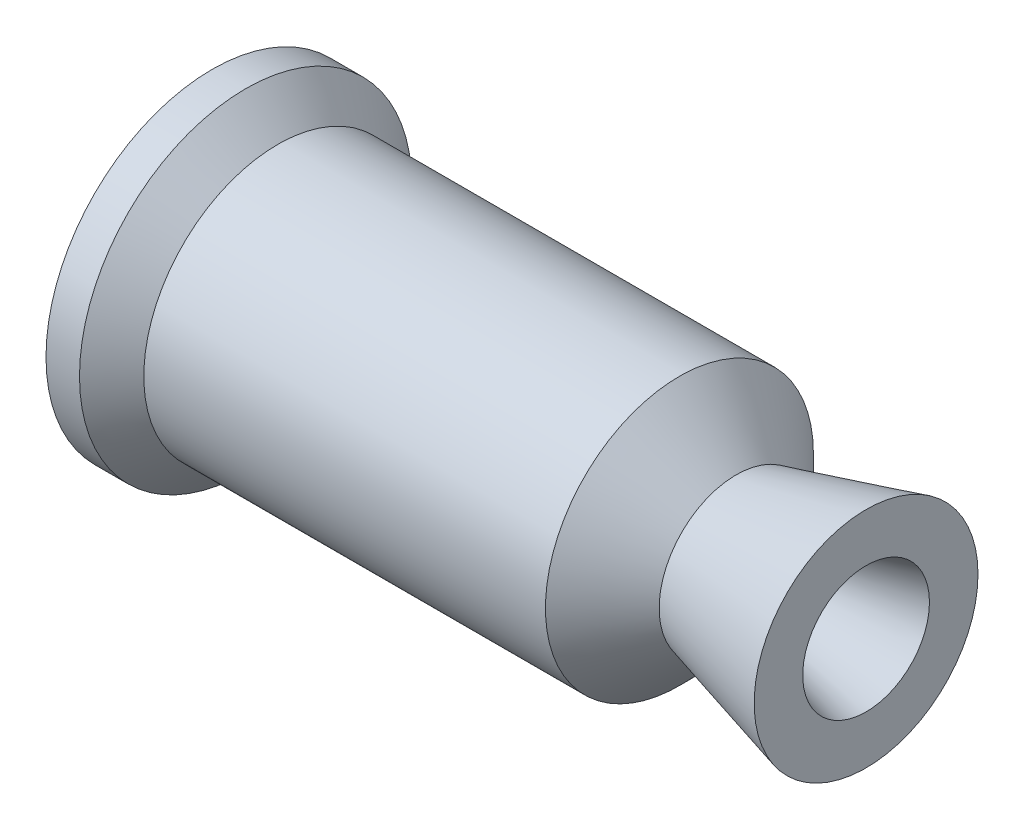
ISO-10303-21;
HEADER;
FILE_DESCRIPTION(('STEP AP214'),'2;1');
FILE_NAME('part.step','',(''),(''),'','','');
FILE_SCHEMA(('AUTOMOTIVE_DESIGN { 1 0 10303 214 1 1 1 1 }'));
ENDSEC;
DATA;
#1=APPLICATION_CONTEXT('core data for automotive mechanical design processes');
#2=APPLICATION_PROTOCOL_DEFINITION('international standard','automotive_design',2000,#1);
#3=PRODUCT_CONTEXT('',#1,'mechanical');
#4=PRODUCT('Part','Part','',(#3));
#5=PRODUCT_RELATED_PRODUCT_CATEGORY('part','',(#4));
#6=PRODUCT_DEFINITION_FORMATION('','',#4);
#7=PRODUCT_DEFINITION_CONTEXT('part definition',#1,'design');
#8=PRODUCT_DEFINITION('design','',#6,#7);
#9=PRODUCT_DEFINITION_SHAPE('','',#8);
#10=(LENGTH_UNIT() NAMED_UNIT(*) SI_UNIT(.MILLI.,.METRE.));
#11=(NAMED_UNIT(*) PLANE_ANGLE_UNIT() SI_UNIT($,.RADIAN.));
#12=(NAMED_UNIT(*) SI_UNIT($,.STERADIAN.) SOLID_ANGLE_UNIT());
#13=UNCERTAINTY_MEASURE_WITH_UNIT(LENGTH_MEASURE(1.E-05),#10,'distance_accuracy_value','');
#14=(GEOMETRIC_REPRESENTATION_CONTEXT(3) GLOBAL_UNCERTAINTY_ASSIGNED_CONTEXT((#13)) GLOBAL_UNIT_ASSIGNED_CONTEXT((#10,
#11,#12)) REPRESENTATION_CONTEXT('',''));
#15=CARTESIAN_POINT('',(0.,0.,0.));
#16=DIRECTION('',(0.,0.,1.));
#17=DIRECTION('',(1.,0.,0.));
#18=AXIS2_PLACEMENT_3D('',#15,#16,#17);
#19=CARTESIAN_POINT('',(0.,0.,0.));
#20=DIRECTION('',(-1.,0.,0.));
#21=DIRECTION('',(0.,0.,1.));
#22=AXIS2_PLACEMENT_3D('',#19,#20,#21);
#23=PLANE('',#22);
#24=CARTESIAN_POINT('',(0.,0.,0.));
#25=DIRECTION('',(1.,0.,0.));
#26=DIRECTION('',(0.,0.,-1.));
#27=AXIS2_PLACEMENT_3D('',#24,#25,#26);
#28=CIRCLE('',#27,18.8722);
#29=CARTESIAN_POINT('',(0.,0.,-18.8722));
#30=VERTEX_POINT('',#29);
#31=EDGE_CURVE('E76',#30,#30,#28,.T.);
#32=ORIENTED_EDGE('',*,*,#31,.T.);
#33=EDGE_LOOP('',(#32));
#34=FACE_BOUND('',#33,.T.);
#35=CARTESIAN_POINT('',(0.,0.,0.));
#36=DIRECTION('',(-1.,0.,0.));
#37=DIRECTION('',(0.,0.,1.));
#38=AXIS2_PLACEMENT_3D('',#35,#36,#37);
#39=CIRCLE('',#38,26.543);
#40=CARTESIAN_POINT('',(0.,0.,26.543));
#41=VERTEX_POINT('',#40);
#42=EDGE_CURVE('E106',#41,#41,#39,.T.);
#43=ORIENTED_EDGE('',*,*,#42,.T.);
#44=EDGE_LOOP('',(#43));
#45=FACE_BOUND('',#44,.T.);
#46=ADVANCED_FACE('F44',(#34,#45),#23,.T.);
#47=CARTESIAN_POINT('',(99.3714501041282,0.,0.));
#48=DIRECTION('',(1.,0.,0.));
#49=DIRECTION('',(0.,0.,-1.));
#50=AXIS2_PLACEMENT_3D('',#47,#48,#49);
#51=CONICAL_SURFACE('',#50,14.6231084653686,0.261799387799151);
#52=CARTESIAN_POINT('',(123.983193541915,0.,0.));
#53=DIRECTION('',(1.,0.,0.));
#54=DIRECTION('',(0.,0.,-1.));
#55=AXIS2_PLACEMENT_3D('',#52,#53,#54);
#56=CIRCLE('',#55,21.2178052438457);
#57=CARTESIAN_POINT('',(123.983193541915,0.,-21.2178052438457));
#58=VERTEX_POINT('',#57);
#59=EDGE_CURVE('E96',#58,#58,#56,.T.);
#60=ORIENTED_EDGE('',*,*,#59,.F.);
#61=EDGE_LOOP('',(#60));
#62=FACE_BOUND('',#61,.T.);
#63=CARTESIAN_POINT('',(99.3714501041282,0.,0.));
#64=DIRECTION('',(1.,0.,0.));
#65=DIRECTION('',(0.,0.,-1.));
#66=AXIS2_PLACEMENT_3D('',#63,#64,#65);
#67=CIRCLE('',#66,14.6231084653686);
#68=CARTESIAN_POINT('',(99.3714501041282,0.,-14.6231084653686));
#69=VERTEX_POINT('',#68);
#70=EDGE_CURVE('E10',#69,#69,#67,.T.);
#71=ORIENTED_EDGE('',*,*,#70,.T.);
#72=EDGE_LOOP('',(#71));
#73=FACE_BOUND('',#72,.T.);
#74=ADVANCED_FACE('F46',(#62,#73),#51,.T.);
#75=CARTESIAN_POINT('',(88.5945585694968,0.,0.));
#76=DIRECTION('',(-1.,0.,0.));
#77=DIRECTION('',(0.,0.,1.));
#78=AXIS2_PLACEMENT_3D('',#75,#76,#77);
#79=CONICAL_SURFACE('',#78,25.4,0.785398163397451);
#80=ORIENTED_EDGE('',*,*,#70,.F.);
#81=EDGE_LOOP('',(#80));
#82=FACE_BOUND('',#81,.T.);
#83=CARTESIAN_POINT('',(88.5945585694968,0.,0.));
#84=DIRECTION('',(1.,0.,0.));
#85=DIRECTION('',(0.,0.,-1.));
#86=AXIS2_PLACEMENT_3D('',#83,#84,#85);
#87=CIRCLE('',#86,25.4);
#88=CARTESIAN_POINT('',(88.5945585694968,0.,-25.4));
#89=VERTEX_POINT('',#88);
#90=EDGE_CURVE('E52',#89,#89,#87,.T.);
#91=ORIENTED_EDGE('',*,*,#90,.T.);
#92=EDGE_LOOP('',(#91));
#93=FACE_BOUND('',#92,.T.);
#94=ADVANCED_FACE('F158',(#82,#93),#79,.T.);
#95=CARTESIAN_POINT('',(0.,0.,0.));
#96=DIRECTION('',(1.,0.,0.));
#97=DIRECTION('',(0.,0.,-1.));
#98=AXIS2_PLACEMENT_3D('',#95,#96,#97);
#99=CYLINDRICAL_SURFACE('',#98,25.4);
#100=CARTESIAN_POINT('',(12.4460000000001,0.,0.));
#101=DIRECTION('',(1.,0.,0.));
#102=DIRECTION('',(0.,0.,-1.));
#103=AXIS2_PLACEMENT_3D('',#100,#101,#102);
#104=CIRCLE('',#103,25.4);
#105=CARTESIAN_POINT('',(12.4460000000001,0.,-25.4));
#106=VERTEX_POINT('',#105);
#107=EDGE_CURVE('E59',#106,#106,#104,.T.);
#108=ORIENTED_EDGE('',*,*,#107,.T.);
#109=EDGE_LOOP('',(#108));
#110=FACE_BOUND('',#109,.T.);
#111=ORIENTED_EDGE('',*,*,#90,.F.);
#112=EDGE_LOOP('',(#111));
#113=FACE_BOUND('',#112,.T.);
#114=ADVANCED_FACE('F149',(#110,#113),#99,.T.);
#115=CARTESIAN_POINT('',(6.35,0.,0.));
#116=DIRECTION('',(-1.,0.,0.));
#117=DIRECTION('',(0.,0.,1.));
#118=AXIS2_PLACEMENT_3D('',#115,#116,#117);
#119=CONICAL_SURFACE('',#118,31.496,0.785398163397443);
#120=ORIENTED_EDGE('',*,*,#107,.F.);
#121=EDGE_LOOP('',(#120));
#122=FACE_BOUND('',#121,.T.);
#123=CARTESIAN_POINT('',(6.35,0.,0.));
#124=DIRECTION('',(1.,0.,0.));
#125=DIRECTION('',(0.,0.,-1.));
#126=AXIS2_PLACEMENT_3D('',#123,#124,#125);
#127=CIRCLE('',#126,31.496);
#128=CARTESIAN_POINT('',(6.35,0.,-31.496));
#129=VERTEX_POINT('',#128);
#130=EDGE_CURVE('E66',#129,#129,#127,.T.);
#131=ORIENTED_EDGE('',*,*,#130,.T.);
#132=EDGE_LOOP('',(#131));
#133=FACE_BOUND('',#132,.T.);
#134=ADVANCED_FACE('F143',(#122,#133),#119,.T.);
#135=CARTESIAN_POINT('',(0.,0.,0.));
#136=DIRECTION('',(1.,0.,0.));
#137=DIRECTION('',(0.,0.,-1.));
#138=AXIS2_PLACEMENT_3D('',#135,#136,#137);
#139=CYLINDRICAL_SURFACE('',#138,31.496);
#140=ORIENTED_EDGE('',*,*,#130,.F.);
#141=EDGE_LOOP('',(#140));
#142=FACE_BOUND('',#141,.T.);
#143=CARTESIAN_POINT('',(0.,0.,0.));
#144=DIRECTION('',(1.,0.,0.));
#145=DIRECTION('',(0.,0.,-1.));
#146=AXIS2_PLACEMENT_3D('',#143,#144,#145);
#147=CIRCLE('',#146,31.496);
#148=CARTESIAN_POINT('',(0.,0.,-31.496));
#149=VERTEX_POINT('',#148);
#150=EDGE_CURVE('E72',#149,#149,#147,.T.);
#151=ORIENTED_EDGE('',*,*,#150,.T.);
#152=EDGE_LOOP('',(#151));
#153=FACE_BOUND('',#152,.T.);
#154=ADVANCED_FACE('F138',(#142,#153),#139,.T.);
#155=CARTESIAN_POINT('',(0.,0.,0.));
#156=DIRECTION('',(-1.,0.,0.));
#157=DIRECTION('',(0.,0.,1.));
#158=AXIS2_PLACEMENT_3D('',#155,#156,#157);
#159=CIRCLE('',#158,29.718);
#160=CARTESIAN_POINT('',(0.,0.,29.718));
#161=VERTEX_POINT('',#160);
#162=EDGE_CURVE('E101',#161,#161,#159,.T.);
#163=ORIENTED_EDGE('',*,*,#162,.F.);
#164=EDGE_LOOP('',(#163));
#165=FACE_BOUND('',#164,.T.);
#166=ORIENTED_EDGE('',*,*,#150,.F.);
#167=EDGE_LOOP('',(#166));
#168=FACE_BOUND('',#167,.T.);
#169=ADVANCED_FACE('F134',(#165,#168),#23,.T.);
#170=CARTESIAN_POINT('',(0.,0.,0.));
#171=DIRECTION('',(1.,0.,0.));
#172=DIRECTION('',(0.,0.,-1.));
#173=AXIS2_PLACEMENT_3D('',#170,#171,#172);
#174=CYLINDRICAL_SURFACE('',#173,18.8722);
#175=CARTESIAN_POINT('',(82.55,0.,0.));
#176=DIRECTION('',(1.,0.,0.));
#177=DIRECTION('',(0.,0.,-1.));
#178=AXIS2_PLACEMENT_3D('',#175,#176,#177);
#179=CIRCLE('',#178,18.8722);
#180=CARTESIAN_POINT('',(82.55,0.,-18.8722));
#181=VERTEX_POINT('',#180);
#182=EDGE_CURVE('E80',#181,#181,#179,.T.);
#183=ORIENTED_EDGE('',*,*,#182,.T.);
#184=EDGE_LOOP('',(#183));
#185=FACE_BOUND('',#184,.T.);
#186=ORIENTED_EDGE('',*,*,#31,.F.);
#187=EDGE_LOOP('',(#186));
#188=FACE_BOUND('',#187,.T.);
#189=ADVANCED_FACE('F137',(#185,#188),#174,.F.);
#190=CARTESIAN_POINT('',(82.55,0.,0.));
#191=DIRECTION('',(-1.,0.,0.));
#192=DIRECTION('',(0.,0.,1.));
#193=AXIS2_PLACEMENT_3D('',#190,#191,#192);
#194=CONICAL_SURFACE('',#193,18.8722,0.78539816339745);
#195=CARTESIAN_POINT('',(95.4531999999999,0.,0.));
#196=DIRECTION('',(1.,0.,0.));
#197=DIRECTION('',(0.,0.,-1.));
#198=AXIS2_PLACEMENT_3D('',#195,#196,#197);
#199=CIRCLE('',#198,5.96900000000003);
#200=CARTESIAN_POINT('',(95.4531999999999,0.,-5.96900000000003));
#201=VERTEX_POINT('',#200);
#202=EDGE_CURVE('E84',#201,#201,#199,.T.);
#203=ORIENTED_EDGE('',*,*,#202,.T.);
#204=EDGE_LOOP('',(#203));
#205=FACE_BOUND('',#204,.T.);
#206=ORIENTED_EDGE('',*,*,#182,.F.);
#207=EDGE_LOOP('',(#206));
#208=FACE_BOUND('',#207,.T.);
#209=ADVANCED_FACE('F164',(#205,#208),#194,.F.);
#210=CARTESIAN_POINT('',(0.,0.,0.));
#211=DIRECTION('',(1.,0.,0.));
#212=DIRECTION('',(0.,0.,-1.));
#213=AXIS2_PLACEMENT_3D('',#210,#211,#212);
#214=CYLINDRICAL_SURFACE('',#213,5.96900000000003);
#215=CARTESIAN_POINT('',(101.4222,0.,0.));
#216=DIRECTION('',(1.,0.,0.));
#217=DIRECTION('',(0.,0.,-1.));
#218=AXIS2_PLACEMENT_3D('',#215,#216,#217);
#219=CIRCLE('',#218,5.96900000000002);
#220=CARTESIAN_POINT('',(101.4222,0.,-5.96900000000002));
#221=VERTEX_POINT('',#220);
#222=EDGE_CURVE('E88',#221,#221,#219,.T.);
#223=ORIENTED_EDGE('',*,*,#222,.T.);
#224=EDGE_LOOP('',(#223));
#225=FACE_BOUND('',#224,.T.);
#226=ORIENTED_EDGE('',*,*,#202,.F.);
#227=EDGE_LOOP('',(#226));
#228=FACE_BOUND('',#227,.T.);
#229=ADVANCED_FACE('F168',(#225,#228),#214,.F.);
#230=CARTESIAN_POINT('',(101.4222,0.,0.));
#231=DIRECTION('',(1.,0.,0.));
#232=DIRECTION('',(0.,0.,-1.));
#233=AXIS2_PLACEMENT_3D('',#230,#231,#232);
#234=CONICAL_SURFACE('',#233,5.96900000000002,0.261799387799151);
#235=CARTESIAN_POINT('',(123.983193541915,0.,0.));
#236=DIRECTION('',(1.,0.,0.));
#237=DIRECTION('',(0.,0.,-1.));
#238=AXIS2_PLACEMENT_3D('',#235,#236,#237);
#239=CIRCLE('',#238,12.0142);
#240=CARTESIAN_POINT('',(123.983193541915,0.,-12.0142));
#241=VERTEX_POINT('',#240);
#242=EDGE_CURVE('E92',#241,#241,#239,.T.);
#243=ORIENTED_EDGE('',*,*,#242,.T.);
#244=EDGE_LOOP('',(#243));
#245=FACE_BOUND('',#244,.T.);
#246=ORIENTED_EDGE('',*,*,#222,.F.);
#247=EDGE_LOOP('',(#246));
#248=FACE_BOUND('',#247,.T.);
#249=ADVANCED_FACE('F172',(#245,#248),#234,.F.);
#250=CARTESIAN_POINT('',(123.983193541915,2.57080256945404E-13,0.));
#251=DIRECTION('',(1.,0.,0.));
#252=DIRECTION('',(0.,0.,-1.));
#253=AXIS2_PLACEMENT_3D('',#250,#251,#252);
#254=PLANE('',#253);
#255=ORIENTED_EDGE('',*,*,#59,.T.);
#256=EDGE_LOOP('',(#255));
#257=FACE_BOUND('',#256,.T.);
#258=ORIENTED_EDGE('',*,*,#242,.F.);
#259=EDGE_LOOP('',(#258));
#260=FACE_BOUND('',#259,.T.);
#261=ADVANCED_FACE('F176',(#257,#260),#254,.T.);
#262=CARTESIAN_POINT('',(2.032,0.,0.));
#263=DIRECTION('',(-1.,0.,0.));
#264=DIRECTION('',(0.,0.,1.));
#265=AXIS2_PLACEMENT_3D('',#262,#263,#264);
#266=CYLINDRICAL_SURFACE('',#265,26.543);
#267=CARTESIAN_POINT('',(2.032,0.,0.));
#268=DIRECTION('',(-1.,0.,0.));
#269=DIRECTION('',(0.,0.,1.));
#270=AXIS2_PLACEMENT_3D('',#267,#268,#269);
#271=CIRCLE('',#270,26.543);
#272=CARTESIAN_POINT('',(2.032,0.,26.543));
#273=VERTEX_POINT('',#272);
#274=EDGE_CURVE('E105',#273,#273,#271,.T.);
#275=ORIENTED_EDGE('',*,*,#274,.T.);
#276=EDGE_LOOP('',(#275));
#277=FACE_BOUND('',#276,.T.);
#278=ORIENTED_EDGE('',*,*,#42,.F.);
#279=EDGE_LOOP('',(#278));
#280=FACE_BOUND('',#279,.T.);
#281=ADVANCED_FACE('F119',(#277,#280),#266,.T.);
#282=CARTESIAN_POINT('',(2.032,0.,0.));
#283=DIRECTION('',(-1.,0.,0.));
#284=DIRECTION('',(0.,0.,1.));
#285=AXIS2_PLACEMENT_3D('',#282,#283,#284);
#286=CYLINDRICAL_SURFACE('',#285,29.718);
#287=CARTESIAN_POINT('',(2.032,0.,0.));
#288=DIRECTION('',(-1.,0.,0.));
#289=DIRECTION('',(0.,0.,1.));
#290=AXIS2_PLACEMENT_3D('',#287,#288,#289);
#291=CIRCLE('',#290,29.718);
#292=CARTESIAN_POINT('',(2.032,0.,29.718));
#293=VERTEX_POINT('',#292);
#294=EDGE_CURVE('E100',#293,#293,#291,.T.);
#295=ORIENTED_EDGE('',*,*,#294,.F.);
#296=EDGE_LOOP('',(#295));
#297=FACE_BOUND('',#296,.T.);
#298=ORIENTED_EDGE('',*,*,#162,.T.);
#299=EDGE_LOOP('',(#298));
#300=FACE_BOUND('',#299,.T.);
#301=ADVANCED_FACE('F125',(#297,#300),#286,.F.);
#302=CARTESIAN_POINT('',(2.032,0.,0.));
#303=DIRECTION('',(-1.,0.,0.));
#304=DIRECTION('',(0.,0.,1.));
#305=AXIS2_PLACEMENT_3D('',#302,#303,#304);
#306=PLANE('',#305);
#307=ORIENTED_EDGE('',*,*,#274,.F.);
#308=EDGE_LOOP('',(#307));
#309=FACE_BOUND('',#308,.T.);
#310=ORIENTED_EDGE('',*,*,#294,.T.);
#311=EDGE_LOOP('',(#310));
#312=FACE_BOUND('',#311,.T.);
#313=ADVANCED_FACE('F122',(#309,#312),#306,.T.);
#314=CLOSED_SHELL('',(#46,#74,#94,#114,#134,#154,#169,#189,#209,#229,#249,#261,#281,#301,#313));
#315=MANIFOLD_SOLID_BREP('B2',#314);
#316=ADVANCED_BREP_SHAPE_REPRESENTATION('',(#18,#315),#14);
#317=SHAPE_DEFINITION_REPRESENTATION(#9,#316);
ENDSEC;
END-ISO-10303-21;
